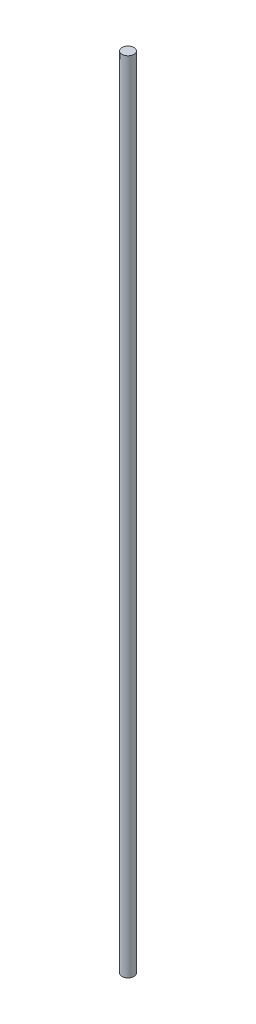
ISO-10303-21;
HEADER;
FILE_DESCRIPTION(('STEP AP214'),'2;1');
FILE_NAME('part.step','',(''),(''),'','','');
FILE_SCHEMA(('AUTOMOTIVE_DESIGN { 1 0 10303 214 1 1 1 1 }'));
ENDSEC;
DATA;
#1=APPLICATION_CONTEXT('core data for automotive mechanical design processes');
#2=APPLICATION_PROTOCOL_DEFINITION('international standard','automotive_design',2000,#1);
#3=PRODUCT_CONTEXT('',#1,'mechanical');
#4=PRODUCT('Part','Part','',(#3));
#5=PRODUCT_RELATED_PRODUCT_CATEGORY('part','',(#4));
#6=PRODUCT_DEFINITION_FORMATION('','',#4);
#7=PRODUCT_DEFINITION_CONTEXT('part definition',#1,'design');
#8=PRODUCT_DEFINITION('design','',#6,#7);
#9=PRODUCT_DEFINITION_SHAPE('','',#8);
#10=(LENGTH_UNIT() NAMED_UNIT(*) SI_UNIT(.MILLI.,.METRE.));
#11=(NAMED_UNIT(*) PLANE_ANGLE_UNIT() SI_UNIT($,.RADIAN.));
#12=(NAMED_UNIT(*) SI_UNIT($,.STERADIAN.) SOLID_ANGLE_UNIT());
#13=UNCERTAINTY_MEASURE_WITH_UNIT(LENGTH_MEASURE(1.E-05),#10,'distance_accuracy_value','');
#14=(GEOMETRIC_REPRESENTATION_CONTEXT(3) GLOBAL_UNCERTAINTY_ASSIGNED_CONTEXT((#13)) GLOBAL_UNIT_ASSIGNED_CONTEXT((#10,
#11,#12)) REPRESENTATION_CONTEXT('',''));
#15=CARTESIAN_POINT('',(0.,0.,0.));
#16=DIRECTION('',(0.,0.,1.));
#17=DIRECTION('',(1.,0.,0.));
#18=AXIS2_PLACEMENT_3D('',#15,#16,#17);
#19=CARTESIAN_POINT('',(0.,50.,0.));
#20=DIRECTION('',(0.,-1.,0.));
#21=DIRECTION('',(0.,0.,-1.));
#22=AXIS2_PLACEMENT_3D('',#19,#20,#21);
#23=CYLINDRICAL_SURFACE('',#22,0.375);
#24=CARTESIAN_POINT('',(0.,50.,0.));
#25=DIRECTION('',(0.,1.,0.));
#26=DIRECTION('',(0.,0.,1.));
#27=AXIS2_PLACEMENT_3D('',#24,#25,#26);
#28=CIRCLE('',#27,0.375);
#29=CARTESIAN_POINT('',(0.,50.,0.375));
#30=VERTEX_POINT('',#29);
#31=EDGE_CURVE('E10',#30,#30,#28,.T.);
#32=ORIENTED_EDGE('',*,*,#31,.F.);
#33=EDGE_LOOP('',(#32));
#34=FACE_BOUND('',#33,.T.);
#35=CARTESIAN_POINT('',(0.,0.,0.));
#36=DIRECTION('',(0.,1.,0.));
#37=DIRECTION('',(0.,0.,1.));
#38=AXIS2_PLACEMENT_3D('',#35,#36,#37);
#39=CIRCLE('',#38,0.375);
#40=CARTESIAN_POINT('',(0.,0.,0.375));
#41=VERTEX_POINT('',#40);
#42=EDGE_CURVE('E34',#41,#41,#39,.T.);
#43=ORIENTED_EDGE('',*,*,#42,.T.);
#44=EDGE_LOOP('',(#43));
#45=FACE_BOUND('',#44,.T.);
#46=ADVANCED_FACE('F31',(#34,#45),#23,.T.);
#47=CARTESIAN_POINT('',(0.,50.,0.));
#48=DIRECTION('',(0.,1.,0.));
#49=DIRECTION('',(0.,0.,1.));
#50=AXIS2_PLACEMENT_3D('',#47,#48,#49);
#51=PLANE('',#50);
#52=ORIENTED_EDGE('',*,*,#31,.T.);
#53=EDGE_LOOP('',(#52));
#54=FACE_BOUND('',#53,.T.);
#55=ADVANCED_FACE('F46',(#54),#51,.T.);
#56=CARTESIAN_POINT('',(0.,0.,0.));
#57=DIRECTION('',(0.,1.,0.));
#58=DIRECTION('',(0.,0.,1.));
#59=AXIS2_PLACEMENT_3D('',#56,#57,#58);
#60=PLANE('',#59);
#61=ORIENTED_EDGE('',*,*,#42,.F.);
#62=EDGE_LOOP('',(#61));
#63=FACE_BOUND('',#62,.T.);
#64=ADVANCED_FACE('F44',(#63),#60,.F.);
#65=CLOSED_SHELL('',(#46,#55,#64));
#66=MANIFOLD_SOLID_BREP('B2',#65);
#67=ADVANCED_BREP_SHAPE_REPRESENTATION('',(#18,#66),#14);
#68=SHAPE_DEFINITION_REPRESENTATION(#9,#67);
ENDSEC;
END-ISO-10303-21;
